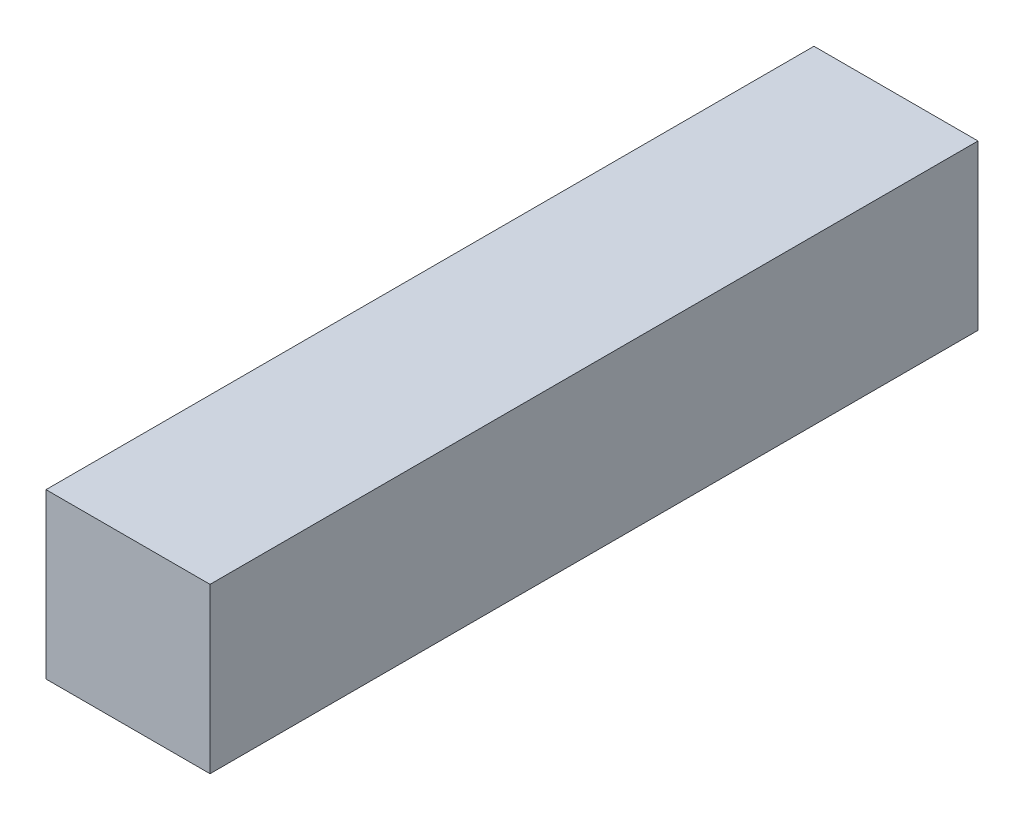
ISO-10303-21;
HEADER;
FILE_DESCRIPTION(('STEP AP214'),'2;1');
FILE_NAME('part.step','',(''),(''),'','','');
FILE_SCHEMA(('AUTOMOTIVE_DESIGN { 1 0 10303 214 1 1 1 1 }'));
ENDSEC;
DATA;
#1=APPLICATION_CONTEXT('core data for automotive mechanical design processes');
#2=APPLICATION_PROTOCOL_DEFINITION('international standard','automotive_design',2000,#1);
#3=PRODUCT_CONTEXT('',#1,'mechanical');
#4=PRODUCT('Part','Part','',(#3));
#5=PRODUCT_RELATED_PRODUCT_CATEGORY('part','',(#4));
#6=PRODUCT_DEFINITION_FORMATION('','',#4);
#7=PRODUCT_DEFINITION_CONTEXT('part definition',#1,'design');
#8=PRODUCT_DEFINITION('design','',#6,#7);
#9=PRODUCT_DEFINITION_SHAPE('','',#8);
#10=(LENGTH_UNIT() NAMED_UNIT(*) SI_UNIT(.MILLI.,.METRE.));
#11=(NAMED_UNIT(*) PLANE_ANGLE_UNIT() SI_UNIT($,.RADIAN.));
#12=(NAMED_UNIT(*) SI_UNIT($,.STERADIAN.) SOLID_ANGLE_UNIT());
#13=UNCERTAINTY_MEASURE_WITH_UNIT(LENGTH_MEASURE(1.E-05),#10,'distance_accuracy_value','');
#14=(GEOMETRIC_REPRESENTATION_CONTEXT(3) GLOBAL_UNCERTAINTY_ASSIGNED_CONTEXT((#13)) GLOBAL_UNIT_ASSIGNED_CONTEXT((#10,
#11,#12)) REPRESENTATION_CONTEXT('',''));
#15=CARTESIAN_POINT('',(0.,0.,0.));
#16=DIRECTION('',(0.,0.,1.));
#17=DIRECTION('',(1.,0.,0.));
#18=AXIS2_PLACEMENT_3D('',#15,#16,#17);
#19=CARTESIAN_POINT('',(0.,0.,-103.));
#20=DIRECTION('',(-1.,0.,0.));
#21=DIRECTION('',(0.,0.,1.));
#22=AXIS2_PLACEMENT_3D('',#19,#20,#21);
#23=PLANE('',#22);
#24=DIRECTION('',(0.,-1.,0.));
#25=VECTOR('',#24,1.);
#26=CARTESIAN_POINT('',(0.,0.,0.));
#27=LINE('',#26,#25);
#28=CARTESIAN_POINT('',(0.,22.,0.));
#29=VERTEX_POINT('',#28);
#30=CARTESIAN_POINT('',(0.,0.,0.));
#31=VERTEX_POINT('',#30);
#32=EDGE_CURVE('E94',#29,#31,#27,.T.);
#33=ORIENTED_EDGE('',*,*,#32,.F.);
#34=DIRECTION('',(0.,0.,1.));
#35=VECTOR('',#34,1.);
#36=CARTESIAN_POINT('',(0.,22.,-103.));
#37=LINE('',#36,#35);
#38=CARTESIAN_POINT('',(0.,22.,-103.));
#39=VERTEX_POINT('',#38);
#40=EDGE_CURVE('E11',#39,#29,#37,.T.);
#41=ORIENTED_EDGE('',*,*,#40,.F.);
#42=DIRECTION('',(0.,-1.,0.));
#43=VECTOR('',#42,1.);
#44=CARTESIAN_POINT('',(0.,0.,-103.));
#45=LINE('',#44,#43);
#46=CARTESIAN_POINT('',(0.,0.,-103.));
#47=VERTEX_POINT('',#46);
#48=EDGE_CURVE('E88',#39,#47,#45,.T.);
#49=ORIENTED_EDGE('',*,*,#48,.T.);
#50=DIRECTION('',(0.,0.,1.));
#51=VECTOR('',#50,1.);
#52=CARTESIAN_POINT('',(0.,0.,-103.));
#53=LINE('',#52,#51);
#54=EDGE_CURVE('E33',#47,#31,#53,.T.);
#55=ORIENTED_EDGE('',*,*,#54,.T.);
#56=EDGE_LOOP('',(#33,#41,#49,#55));
#57=FACE_BOUND('',#56,.T.);
#58=ADVANCED_FACE('F30',(#57),#23,.T.);
#59=CARTESIAN_POINT('',(0.,22.,-103.));
#60=DIRECTION('',(0.,1.,0.));
#61=DIRECTION('',(0.,0.,1.));
#62=AXIS2_PLACEMENT_3D('',#59,#60,#61);
#63=PLANE('',#62);
#64=DIRECTION('',(-1.,0.,0.));
#65=VECTOR('',#64,1.);
#66=CARTESIAN_POINT('',(0.,22.,0.));
#67=LINE('',#66,#65);
#68=CARTESIAN_POINT('',(22.,22.,0.));
#69=VERTEX_POINT('',#68);
#70=EDGE_CURVE('E90',#69,#29,#67,.T.);
#71=ORIENTED_EDGE('',*,*,#70,.F.);
#72=DIRECTION('',(0.,0.,1.));
#73=VECTOR('',#72,1.);
#74=CARTESIAN_POINT('',(22.,22.,-103.));
#75=LINE('',#74,#73);
#76=CARTESIAN_POINT('',(22.,22.,-103.));
#77=VERTEX_POINT('',#76);
#78=EDGE_CURVE('E39',#77,#69,#75,.T.);
#79=ORIENTED_EDGE('',*,*,#78,.F.);
#80=DIRECTION('',(-1.,0.,0.));
#81=VECTOR('',#80,1.);
#82=CARTESIAN_POINT('',(0.,22.,-103.));
#83=LINE('',#82,#81);
#84=EDGE_CURVE('E85',#77,#39,#83,.T.);
#85=ORIENTED_EDGE('',*,*,#84,.T.);
#86=ORIENTED_EDGE('',*,*,#40,.T.);
#87=EDGE_LOOP('',(#71,#79,#85,#86));
#88=FACE_BOUND('',#87,.T.);
#89=ADVANCED_FACE('F104',(#88),#63,.T.);
#90=CARTESIAN_POINT('',(22.,0.,-103.));
#91=DIRECTION('',(1.,0.,0.));
#92=DIRECTION('',(0.,0.,-1.));
#93=AXIS2_PLACEMENT_3D('',#90,#91,#92);
#94=PLANE('',#93);
#95=DIRECTION('',(0.,1.,0.));
#96=VECTOR('',#95,1.);
#97=CARTESIAN_POINT('',(22.,0.,0.));
#98=LINE('',#97,#96);
#99=CARTESIAN_POINT('',(22.,0.,0.));
#100=VERTEX_POINT('',#99);
#101=EDGE_CURVE('E80',#100,#69,#98,.T.);
#102=ORIENTED_EDGE('',*,*,#101,.F.);
#103=DIRECTION('',(0.,0.,1.));
#104=VECTOR('',#103,1.);
#105=CARTESIAN_POINT('',(22.,0.,-103.));
#106=LINE('',#105,#104);
#107=CARTESIAN_POINT('',(22.,0.,-103.));
#108=VERTEX_POINT('',#107);
#109=EDGE_CURVE('E75',#108,#100,#106,.T.);
#110=ORIENTED_EDGE('',*,*,#109,.F.);
#111=DIRECTION('',(0.,1.,0.));
#112=VECTOR('',#111,1.);
#113=CARTESIAN_POINT('',(22.,0.,-103.));
#114=LINE('',#113,#112);
#115=EDGE_CURVE('E78',#108,#77,#114,.T.);
#116=ORIENTED_EDGE('',*,*,#115,.T.);
#117=ORIENTED_EDGE('',*,*,#78,.T.);
#118=EDGE_LOOP('',(#102,#110,#116,#117));
#119=FACE_BOUND('',#118,.T.);
#120=ADVANCED_FACE('F77',(#119),#94,.T.);
#121=CARTESIAN_POINT('',(0.,0.,-103.));
#122=DIRECTION('',(0.,-1.,0.));
#123=DIRECTION('',(0.,0.,-1.));
#124=AXIS2_PLACEMENT_3D('',#121,#122,#123);
#125=PLANE('',#124);
#126=DIRECTION('',(1.,0.,0.));
#127=VECTOR('',#126,1.);
#128=CARTESIAN_POINT('',(0.,0.,0.));
#129=LINE('',#128,#127);
#130=EDGE_CURVE('E97',#31,#100,#129,.T.);
#131=ORIENTED_EDGE('',*,*,#130,.F.);
#132=ORIENTED_EDGE('',*,*,#54,.F.);
#133=DIRECTION('',(1.,0.,0.));
#134=VECTOR('',#133,1.);
#135=CARTESIAN_POINT('',(0.,0.,-103.));
#136=LINE('',#135,#134);
#137=EDGE_CURVE('E84',#47,#108,#136,.T.);
#138=ORIENTED_EDGE('',*,*,#137,.T.);
#139=ORIENTED_EDGE('',*,*,#109,.T.);
#140=EDGE_LOOP('',(#131,#132,#138,#139));
#141=FACE_BOUND('',#140,.T.);
#142=ADVANCED_FACE('F87',(#141),#125,.T.);
#143=CARTESIAN_POINT('',(0.,22.,-103.));
#144=DIRECTION('',(0.,0.,-1.));
#145=DIRECTION('',(-1.,0.,0.));
#146=AXIS2_PLACEMENT_3D('',#143,#144,#145);
#147=PLANE('',#146);
#148=ORIENTED_EDGE('',*,*,#48,.F.);
#149=ORIENTED_EDGE('',*,*,#84,.F.);
#150=ORIENTED_EDGE('',*,*,#115,.F.);
#151=ORIENTED_EDGE('',*,*,#137,.F.);
#152=EDGE_LOOP('',(#148,#149,#150,#151));
#153=FACE_BOUND('',#152,.T.);
#154=ADVANCED_FACE('F83',(#153),#147,.T.);
#155=CARTESIAN_POINT('',(0.,22.,0.));
#156=DIRECTION('',(0.,0.,-1.));
#157=DIRECTION('',(-1.,0.,0.));
#158=AXIS2_PLACEMENT_3D('',#155,#156,#157);
#159=PLANE('',#158);
#160=ORIENTED_EDGE('',*,*,#32,.T.);
#161=ORIENTED_EDGE('',*,*,#130,.T.);
#162=ORIENTED_EDGE('',*,*,#101,.T.);
#163=ORIENTED_EDGE('',*,*,#70,.T.);
#164=EDGE_LOOP('',(#160,#161,#162,#163));
#165=FACE_BOUND('',#164,.T.);
#166=ADVANCED_FACE('F103',(#165),#159,.F.);
#167=CLOSED_SHELL('',(#58,#89,#120,#142,#154,#166));
#168=MANIFOLD_SOLID_BREP('B2',#167);
#169=ADVANCED_BREP_SHAPE_REPRESENTATION('',(#18,#168),#14);
#170=SHAPE_DEFINITION_REPRESENTATION(#9,#169);
ENDSEC;
END-ISO-10303-21;
